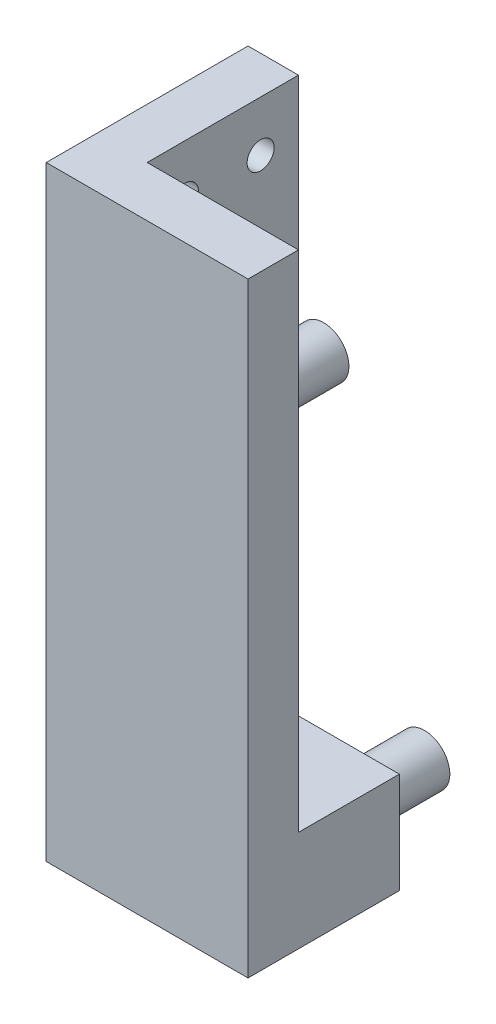
ISO-10303-21;
HEADER;
FILE_DESCRIPTION(('STEP AP214'),'2;1');
FILE_NAME('part.step','',(''),(''),'','','');
FILE_SCHEMA(('AUTOMOTIVE_DESIGN { 1 0 10303 214 1 1 1 1 }'));
ENDSEC;
DATA;
#1=APPLICATION_CONTEXT('core data for automotive mechanical design processes');
#2=APPLICATION_PROTOCOL_DEFINITION('international standard','automotive_design',2000,#1);
#3=PRODUCT_CONTEXT('',#1,'mechanical');
#4=PRODUCT('Part','Part','',(#3));
#5=PRODUCT_RELATED_PRODUCT_CATEGORY('part','',(#4));
#6=PRODUCT_DEFINITION_FORMATION('','',#4);
#7=PRODUCT_DEFINITION_CONTEXT('part definition',#1,'design');
#8=PRODUCT_DEFINITION('design','',#6,#7);
#9=PRODUCT_DEFINITION_SHAPE('','',#8);
#10=(LENGTH_UNIT() NAMED_UNIT(*) SI_UNIT(.MILLI.,.METRE.));
#11=(NAMED_UNIT(*) PLANE_ANGLE_UNIT() SI_UNIT($,.RADIAN.));
#12=(NAMED_UNIT(*) SI_UNIT($,.STERADIAN.) SOLID_ANGLE_UNIT());
#13=UNCERTAINTY_MEASURE_WITH_UNIT(LENGTH_MEASURE(1.E-05),#10,'distance_accuracy_value','');
#14=(GEOMETRIC_REPRESENTATION_CONTEXT(3) GLOBAL_UNCERTAINTY_ASSIGNED_CONTEXT((#13)) GLOBAL_UNIT_ASSIGNED_CONTEXT((#10,
#11,#12)) REPRESENTATION_CONTEXT('',''));
#15=CARTESIAN_POINT('',(0.,0.,0.));
#16=DIRECTION('',(0.,0.,1.));
#17=DIRECTION('',(1.,0.,0.));
#18=AXIS2_PLACEMENT_3D('',#15,#16,#17);
#19=CARTESIAN_POINT('',(0.,0.,25.4));
#20=DIRECTION('',(-1.,0.,0.));
#21=DIRECTION('',(0.,-1.,0.));
#22=AXIS2_PLACEMENT_3D('',#19,#20,#21);
#23=PLANE('',#22);
#24=CARTESIAN_POINT('',(0.,69.85,14.2875));
#25=DIRECTION('',(-1.,0.,0.));
#26=DIRECTION('',(0.,1.,0.));
#27=AXIS2_PLACEMENT_3D('',#24,#25,#26);
#28=CIRCLE('',#27,1.700000029);
#29=CARTESIAN_POINT('',(0.,71.550000029,14.2875));
#30=VERTEX_POINT('',#29);
#31=EDGE_CURVE('E224',#30,#30,#28,.T.);
#32=ORIENTED_EDGE('',*,*,#31,.F.);
#33=EDGE_LOOP('',(#32));
#34=FACE_BOUND('',#33,.T.);
#35=CARTESIAN_POINT('',(0.,19.0499999999999,4.7625));
#36=DIRECTION('',(-1.,0.,0.));
#37=DIRECTION('',(0.,1.,0.));
#38=AXIS2_PLACEMENT_3D('',#35,#36,#37);
#39=CIRCLE('',#38,1.700000029);
#40=CARTESIAN_POINT('',(0.,20.7500000289999,4.7625));
#41=VERTEX_POINT('',#40);
#42=EDGE_CURVE('E228',#41,#41,#39,.T.);
#43=ORIENTED_EDGE('',*,*,#42,.F.);
#44=EDGE_LOOP('',(#43));
#45=FACE_BOUND('',#44,.T.);
#46=CARTESIAN_POINT('',(0.,19.05,14.2875));
#47=DIRECTION('',(-1.,0.,0.));
#48=DIRECTION('',(0.,1.,0.));
#49=AXIS2_PLACEMENT_3D('',#46,#47,#48);
#50=CIRCLE('',#49,1.700000029);
#51=CARTESIAN_POINT('',(0.,20.750000029,14.2875));
#52=VERTEX_POINT('',#51);
#53=EDGE_CURVE('E232',#52,#52,#50,.T.);
#54=ORIENTED_EDGE('',*,*,#53,.F.);
#55=EDGE_LOOP('',(#54));
#56=FACE_BOUND('',#55,.T.);
#57=CARTESIAN_POINT('',(0.,69.85,4.7625));
#58=DIRECTION('',(-1.,0.,0.));
#59=DIRECTION('',(0.,1.,0.));
#60=AXIS2_PLACEMENT_3D('',#57,#58,#59);
#61=CIRCLE('',#60,1.700000029);
#62=CARTESIAN_POINT('',(0.,71.550000029,4.7625));
#63=VERTEX_POINT('',#62);
#64=EDGE_CURVE('E236',#63,#63,#61,.T.);
#65=ORIENTED_EDGE('',*,*,#64,.F.);
#66=EDGE_LOOP('',(#65));
#67=FACE_BOUND('',#66,.T.);
#68=DIRECTION('',(0.,-1.,0.));
#69=VECTOR('',#68,1.);
#70=CARTESIAN_POINT('',(0.,0.,0.));
#71=LINE('',#70,#69);
#72=CARTESIAN_POINT('',(0.,76.2,0.));
#73=VERTEX_POINT('',#72);
#74=CARTESIAN_POINT('',(0.,0.,0.));
#75=VERTEX_POINT('',#74);
#76=EDGE_CURVE('E164',#73,#75,#71,.T.);
#77=ORIENTED_EDGE('',*,*,#76,.T.);
#78=DIRECTION('',(0.,0.,-1.));
#79=VECTOR('',#78,1.);
#80=CARTESIAN_POINT('',(0.,0.,25.4));
#81=LINE('',#80,#79);
#82=CARTESIAN_POINT('',(0.,0.,25.4));
#83=VERTEX_POINT('',#82);
#84=EDGE_CURVE('E175',#83,#75,#81,.T.);
#85=ORIENTED_EDGE('',*,*,#84,.F.);
#86=DIRECTION('',(0.,-1.,0.));
#87=VECTOR('',#86,1.);
#88=CARTESIAN_POINT('',(0.,0.,25.4));
#89=LINE('',#88,#87);
#90=CARTESIAN_POINT('',(0.,76.2,25.4));
#91=VERTEX_POINT('',#90);
#92=EDGE_CURVE('E165',#91,#83,#89,.T.);
#93=ORIENTED_EDGE('',*,*,#92,.F.);
#94=DIRECTION('',(0.,0.,-1.));
#95=VECTOR('',#94,1.);
#96=CARTESIAN_POINT('',(0.,76.2,25.4));
#97=LINE('',#96,#95);
#98=EDGE_CURVE('E182',#91,#73,#97,.T.);
#99=ORIENTED_EDGE('',*,*,#98,.T.);
#100=EDGE_LOOP('',(#77,#85,#93,#99));
#101=FACE_BOUND('',#100,.T.);
#102=ADVANCED_FACE('F41',(#34,#45,#56,#67,#101),#23,.T.);
#103=CARTESIAN_POINT('',(0.,76.2,25.4));
#104=DIRECTION('',(0.,1.,0.));
#105=DIRECTION('',(0.,0.,-1.));
#106=AXIS2_PLACEMENT_3D('',#103,#104,#105);
#107=PLANE('',#106);
#108=DIRECTION('',(0.,0.,-1.));
#109=VECTOR('',#108,1.);
#110=CARTESIAN_POINT('',(6.34999999999998,76.2,19.05));
#111=LINE('',#110,#109);
#112=CARTESIAN_POINT('',(6.34999999999998,76.2,19.05));
#113=VERTEX_POINT('',#112);
#114=CARTESIAN_POINT('',(6.34999999999998,76.2,0.));
#115=VERTEX_POINT('',#114);
#116=EDGE_CURVE('E149',#113,#115,#111,.T.);
#117=ORIENTED_EDGE('',*,*,#116,.T.);
#118=DIRECTION('',(-1.,0.,0.));
#119=VECTOR('',#118,1.);
#120=CARTESIAN_POINT('',(0.,76.2,0.));
#121=LINE('',#120,#119);
#122=EDGE_CURVE('E169',#115,#73,#121,.T.);
#123=ORIENTED_EDGE('',*,*,#122,.T.);
#124=ORIENTED_EDGE('',*,*,#98,.F.);
#125=DIRECTION('',(-1.,0.,0.));
#126=VECTOR('',#125,1.);
#127=CARTESIAN_POINT('',(0.,76.2,25.4));
#128=LINE('',#127,#126);
#129=CARTESIAN_POINT('',(25.4,76.2,25.4));
#130=VERTEX_POINT('',#129);
#131=EDGE_CURVE('E173',#130,#91,#128,.T.);
#132=ORIENTED_EDGE('',*,*,#131,.F.);
#133=DIRECTION('',(0.,0.,-1.));
#134=VECTOR('',#133,1.);
#135=CARTESIAN_POINT('',(25.4,76.2,25.4));
#136=LINE('',#135,#134);
#137=CARTESIAN_POINT('',(25.4,76.2,19.05));
#138=VERTEX_POINT('',#137);
#139=EDGE_CURVE('E185',#130,#138,#136,.T.);
#140=ORIENTED_EDGE('',*,*,#139,.T.);
#141=DIRECTION('',(1.,0.,0.));
#142=VECTOR('',#141,1.);
#143=CARTESIAN_POINT('',(-78.5451621680164,76.1999999999999,19.05));
#144=LINE('',#143,#142);
#145=EDGE_CURVE('E154',#113,#138,#144,.T.);
#146=ORIENTED_EDGE('',*,*,#145,.F.);
#147=EDGE_LOOP('',(#117,#123,#124,#132,#140,#146));
#148=FACE_BOUND('',#147,.T.);
#149=ADVANCED_FACE('F213',(#148),#107,.T.);
#150=CARTESIAN_POINT('',(25.4,0.,25.4));
#151=DIRECTION('',(1.,0.,0.));
#152=DIRECTION('',(0.,1.,0.));
#153=AXIS2_PLACEMENT_3D('',#150,#151,#152);
#154=PLANE('',#153);
#155=DIRECTION('',(0.,1.,0.));
#156=VECTOR('',#155,1.);
#157=CARTESIAN_POINT('',(25.4,76.2,19.05));
#158=LINE('',#157,#156);
#159=CARTESIAN_POINT('',(25.4,12.7,19.05));
#160=VERTEX_POINT('',#159);
#161=EDGE_CURVE('E145',#160,#138,#158,.T.);
#162=ORIENTED_EDGE('',*,*,#161,.T.);
#163=ORIENTED_EDGE('',*,*,#139,.F.);
#164=DIRECTION('',(0.,1.,0.));
#165=VECTOR('',#164,1.);
#166=CARTESIAN_POINT('',(25.4,0.,25.4));
#167=LINE('',#166,#165);
#168=CARTESIAN_POINT('',(25.4,0.,25.4));
#169=VERTEX_POINT('',#168);
#170=EDGE_CURVE('E171',#169,#130,#167,.T.);
#171=ORIENTED_EDGE('',*,*,#170,.F.);
#172=DIRECTION('',(0.,0.,-1.));
#173=VECTOR('',#172,1.);
#174=CARTESIAN_POINT('',(25.4,0.,25.4));
#175=LINE('',#174,#173);
#176=CARTESIAN_POINT('',(25.4,0.,6.35000000000001));
#177=VERTEX_POINT('',#176);
#178=EDGE_CURVE('E188',#169,#177,#175,.T.);
#179=ORIENTED_EDGE('',*,*,#178,.T.);
#180=DIRECTION('',(0.,-1.,0.));
#181=VECTOR('',#180,1.);
#182=CARTESIAN_POINT('',(25.4,76.1999999999999,6.35));
#183=LINE('',#182,#181);
#184=CARTESIAN_POINT('',(25.4,12.7,6.35));
#185=VERTEX_POINT('',#184);
#186=EDGE_CURVE('E120',#185,#177,#183,.T.);
#187=ORIENTED_EDGE('',*,*,#186,.F.);
#188=DIRECTION('',(0.,0.,1.));
#189=VECTOR('',#188,1.);
#190=CARTESIAN_POINT('',(25.4,12.7,6.35));
#191=LINE('',#190,#189);
#192=EDGE_CURVE('E116',#185,#160,#191,.T.);
#193=ORIENTED_EDGE('',*,*,#192,.T.);
#194=EDGE_LOOP('',(#162,#163,#171,#179,#187,#193));
#195=FACE_BOUND('',#194,.T.);
#196=ADVANCED_FACE('F218',(#195),#154,.T.);
#197=CARTESIAN_POINT('',(0.,0.,25.4));
#198=DIRECTION('',(0.,-1.,0.));
#199=DIRECTION('',(0.,0.,1.));
#200=AXIS2_PLACEMENT_3D('',#197,#198,#199);
#201=PLANE('',#200);
#202=DIRECTION('',(0.,0.,1.));
#203=VECTOR('',#202,1.);
#204=CARTESIAN_POINT('',(6.34999999999999,0.,19.05));
#205=LINE('',#204,#203);
#206=CARTESIAN_POINT('',(6.34999999999999,0.,0.));
#207=VERTEX_POINT('',#206);
#208=CARTESIAN_POINT('',(6.34999999999999,0.,19.05));
#209=VERTEX_POINT('',#208);
#210=EDGE_CURVE('E156',#207,#209,#205,.T.);
#211=ORIENTED_EDGE('',*,*,#210,.T.);
#212=DIRECTION('',(1.,0.,0.));
#213=VECTOR('',#212,1.);
#214=CARTESIAN_POINT('',(-78.5451621680164,0.,19.05));
#215=LINE('',#214,#213);
#216=CARTESIAN_POINT('',(12.7,0.,19.05));
#217=VERTEX_POINT('',#216);
#218=EDGE_CURVE('E155',#209,#217,#215,.T.);
#219=ORIENTED_EDGE('',*,*,#218,.T.);
#220=DIRECTION('',(0.,0.,1.));
#221=VECTOR('',#220,1.);
#222=CARTESIAN_POINT('',(12.7,0.,6.35000000000001));
#223=LINE('',#222,#221);
#224=CARTESIAN_POINT('',(12.7,0.,6.35000000000001));
#225=VERTEX_POINT('',#224);
#226=EDGE_CURVE('E133',#225,#217,#223,.T.);
#227=ORIENTED_EDGE('',*,*,#226,.F.);
#228=DIRECTION('',(-1.,0.,0.));
#229=VECTOR('',#228,1.);
#230=CARTESIAN_POINT('',(-78.5451621680164,0.,6.35000000000001));
#231=LINE('',#230,#229);
#232=EDGE_CURVE('E125',#177,#225,#231,.T.);
#233=ORIENTED_EDGE('',*,*,#232,.F.);
#234=ORIENTED_EDGE('',*,*,#178,.F.);
#235=DIRECTION('',(1.,0.,0.));
#236=VECTOR('',#235,1.);
#237=CARTESIAN_POINT('',(0.,0.,25.4));
#238=LINE('',#237,#236);
#239=EDGE_CURVE('E168',#83,#169,#238,.T.);
#240=ORIENTED_EDGE('',*,*,#239,.F.);
#241=ORIENTED_EDGE('',*,*,#84,.T.);
#242=DIRECTION('',(1.,0.,0.));
#243=VECTOR('',#242,1.);
#244=CARTESIAN_POINT('',(0.,0.,0.));
#245=LINE('',#244,#243);
#246=EDGE_CURVE('E178',#75,#207,#245,.T.);
#247=ORIENTED_EDGE('',*,*,#246,.T.);
#248=EDGE_LOOP('',(#211,#219,#227,#233,#234,#240,#241,#247));
#249=FACE_BOUND('',#248,.T.);
#250=ADVANCED_FACE('F244',(#249),#201,.T.);
#251=CARTESIAN_POINT('',(0.,0.,25.4));
#252=DIRECTION('',(0.,0.,1.));
#253=DIRECTION('',(-1.,0.,0.));
#254=AXIS2_PLACEMENT_3D('',#251,#252,#253);
#255=PLANE('',#254);
#256=ORIENTED_EDGE('',*,*,#92,.T.);
#257=ORIENTED_EDGE('',*,*,#239,.T.);
#258=ORIENTED_EDGE('',*,*,#170,.T.);
#259=ORIENTED_EDGE('',*,*,#131,.T.);
#260=EDGE_LOOP('',(#256,#257,#258,#259));
#261=FACE_BOUND('',#260,.T.);
#262=ADVANCED_FACE('F248',(#261),#255,.T.);
#263=CARTESIAN_POINT('',(0.,0.,0.));
#264=DIRECTION('',(0.,0.,1.));
#265=DIRECTION('',(-1.,0.,0.));
#266=AXIS2_PLACEMENT_3D('',#263,#264,#265);
#267=PLANE('',#266);
#268=ORIENTED_EDGE('',*,*,#246,.F.);
#269=ORIENTED_EDGE('',*,*,#76,.F.);
#270=ORIENTED_EDGE('',*,*,#122,.F.);
#271=DIRECTION('',(0.,-1.,0.));
#272=VECTOR('',#271,1.);
#273=CARTESIAN_POINT('',(6.34999999999998,76.2,0.));
#274=LINE('',#273,#272);
#275=EDGE_CURVE('E63',#115,#207,#274,.T.);
#276=ORIENTED_EDGE('',*,*,#275,.T.);
#277=EDGE_LOOP('',(#268,#269,#270,#276));
#278=FACE_BOUND('',#277,.T.);
#279=ADVANCED_FACE('F242',(#278),#267,.F.);
#280=CARTESIAN_POINT('',(6.35,0.,25.4));
#281=DIRECTION('',(-1.,0.,0.));
#282=DIRECTION('',(0.,-1.,0.));
#283=AXIS2_PLACEMENT_3D('',#280,#281,#282);
#284=PLANE('',#283);
#285=CARTESIAN_POINT('',(6.34999999999999,69.85,14.2875));
#286=DIRECTION('',(-1.,0.,0.));
#287=DIRECTION('',(0.,1.,0.));
#288=AXIS2_PLACEMENT_3D('',#285,#286,#287);
#289=CIRCLE('',#288,1.700000029);
#290=CARTESIAN_POINT('',(6.34999999999999,71.550000029,14.2875));
#291=VERTEX_POINT('',#290);
#292=EDGE_CURVE('E271',#291,#291,#289,.T.);
#293=ORIENTED_EDGE('',*,*,#292,.T.);
#294=EDGE_LOOP('',(#293));
#295=FACE_BOUND('',#294,.T.);
#296=CARTESIAN_POINT('',(6.35,19.0499999999999,4.7625));
#297=DIRECTION('',(-1.,0.,0.));
#298=DIRECTION('',(0.,1.,0.));
#299=AXIS2_PLACEMENT_3D('',#296,#297,#298);
#300=CIRCLE('',#299,1.700000029);
#301=CARTESIAN_POINT('',(6.35,20.7500000289999,4.7625));
#302=VERTEX_POINT('',#301);
#303=EDGE_CURVE('E274',#302,#302,#300,.T.);
#304=ORIENTED_EDGE('',*,*,#303,.T.);
#305=EDGE_LOOP('',(#304));
#306=FACE_BOUND('',#305,.T.);
#307=CARTESIAN_POINT('',(6.35,19.05,14.2875));
#308=DIRECTION('',(-1.,0.,0.));
#309=DIRECTION('',(0.,1.,0.));
#310=AXIS2_PLACEMENT_3D('',#307,#308,#309);
#311=CIRCLE('',#310,1.700000029);
#312=CARTESIAN_POINT('',(6.35,20.750000029,14.2875));
#313=VERTEX_POINT('',#312);
#314=EDGE_CURVE('E275',#313,#313,#311,.T.);
#315=ORIENTED_EDGE('',*,*,#314,.T.);
#316=EDGE_LOOP('',(#315));
#317=FACE_BOUND('',#316,.T.);
#318=CARTESIAN_POINT('',(6.34999999999999,69.85,4.7625));
#319=DIRECTION('',(-1.,0.,0.));
#320=DIRECTION('',(0.,1.,0.));
#321=AXIS2_PLACEMENT_3D('',#318,#319,#320);
#322=CIRCLE('',#321,1.700000029);
#323=CARTESIAN_POINT('',(6.34999999999999,71.550000029,4.7625));
#324=VERTEX_POINT('',#323);
#325=EDGE_CURVE('E268',#324,#324,#322,.T.);
#326=ORIENTED_EDGE('',*,*,#325,.T.);
#327=EDGE_LOOP('',(#326));
#328=FACE_BOUND('',#327,.T.);
#329=DIRECTION('',(0.,1.,0.));
#330=VECTOR('',#329,1.);
#331=CARTESIAN_POINT('',(6.34999999999998,76.2,19.05));
#332=LINE('',#331,#330);
#333=EDGE_CURVE('E152',#209,#113,#332,.T.);
#334=ORIENTED_EDGE('',*,*,#333,.F.);
#335=ORIENTED_EDGE('',*,*,#210,.F.);
#336=ORIENTED_EDGE('',*,*,#275,.F.);
#337=ORIENTED_EDGE('',*,*,#116,.F.);
#338=EDGE_LOOP('',(#334,#335,#336,#337));
#339=FACE_BOUND('',#338,.T.);
#340=ADVANCED_FACE('F252',(#295,#306,#317,#328,#339),#284,.F.);
#341=CARTESIAN_POINT('',(-78.5451621680164,76.1999999999999,19.05));
#342=DIRECTION('',(0.,0.,1.));
#343=DIRECTION('',(0.,1.,0.));
#344=AXIS2_PLACEMENT_3D('',#341,#342,#343);
#345=PLANE('',#344);
#346=CARTESIAN_POINT('',(19.05,57.15,19.05));
#347=DIRECTION('',(0.,0.,-1.));
#348=DIRECTION('',(0.,1.,0.));
#349=AXIS2_PLACEMENT_3D('',#346,#347,#348);
#350=CIRCLE('',#349,3.175);
#351=CARTESIAN_POINT('',(15.875,57.15,19.05));
#352=VERTEX_POINT('',#351);
#353=EDGE_CURVE('E141',#352,#352,#350,.T.);
#354=ORIENTED_EDGE('',*,*,#353,.F.);
#355=EDGE_LOOP('',(#354));
#356=FACE_BOUND('',#355,.T.);
#357=ORIENTED_EDGE('',*,*,#218,.F.);
#358=ORIENTED_EDGE('',*,*,#333,.T.);
#359=ORIENTED_EDGE('',*,*,#145,.T.);
#360=ORIENTED_EDGE('',*,*,#161,.F.);
#361=DIRECTION('',(1.,0.,0.));
#362=VECTOR('',#361,1.);
#363=CARTESIAN_POINT('',(-78.5451621680164,12.7,19.05));
#364=LINE('',#363,#362);
#365=CARTESIAN_POINT('',(12.7,12.7,19.05));
#366=VERTEX_POINT('',#365);
#367=EDGE_CURVE('E55',#366,#160,#364,.T.);
#368=ORIENTED_EDGE('',*,*,#367,.F.);
#369=DIRECTION('',(0.,1.,0.));
#370=VECTOR('',#369,1.);
#371=CARTESIAN_POINT('',(12.7,76.1999999999999,19.05));
#372=LINE('',#371,#370);
#373=EDGE_CURVE('E131',#217,#366,#372,.T.);
#374=ORIENTED_EDGE('',*,*,#373,.F.);
#375=EDGE_LOOP('',(#357,#358,#359,#360,#368,#374));
#376=FACE_BOUND('',#375,.T.);
#377=ADVANCED_FACE('F207',(#356,#376),#345,.F.);
#378=CARTESIAN_POINT('',(19.05,57.15,9.525));
#379=DIRECTION('',(0.,0.,1.));
#380=DIRECTION('',(-1.,0.,0.));
#381=AXIS2_PLACEMENT_3D('',#378,#379,#380);
#382=CYLINDRICAL_SURFACE('',#381,3.175);
#383=CARTESIAN_POINT('',(19.05,57.15,9.525));
#384=DIRECTION('',(0.,0.,-1.));
#385=DIRECTION('',(0.,1.,0.));
#386=AXIS2_PLACEMENT_3D('',#383,#384,#385);
#387=CIRCLE('',#386,3.175);
#388=CARTESIAN_POINT('',(15.875,57.15,9.525));
#389=VERTEX_POINT('',#388);
#390=EDGE_CURVE('E142',#389,#389,#387,.T.);
#391=CARTESIAN_POINT('',(15.875,57.15,9.525));
#392=CARTESIAN_POINT('',(15.875,57.15,9.62421875));
#393=CARTESIAN_POINT('',(15.875,57.15,9.7234375));
#394=CARTESIAN_POINT('',(15.875,57.15,9.921875));
#395=CARTESIAN_POINT('',(15.875,57.15,10.02109375));
#396=CARTESIAN_POINT('',(15.875,57.15,10.21953125));
#397=CARTESIAN_POINT('',(15.875,57.15,10.31875));
#398=CARTESIAN_POINT('',(15.875,57.15,10.5171875));
#399=CARTESIAN_POINT('',(15.875,57.15,10.61640625));
#400=CARTESIAN_POINT('',(15.875,57.15,10.81484375));
#401=CARTESIAN_POINT('',(15.875,57.15,10.9140625));
#402=CARTESIAN_POINT('',(15.875,57.15,11.1125));
#403=CARTESIAN_POINT('',(15.875,57.15,11.21171875));
#404=CARTESIAN_POINT('',(15.875,57.15,11.41015625));
#405=CARTESIAN_POINT('',(15.875,57.15,11.509375));
#406=CARTESIAN_POINT('',(15.875,57.15,11.7078125));
#407=CARTESIAN_POINT('',(15.875,57.15,11.80703125));
#408=CARTESIAN_POINT('',(15.875,57.15,12.00546875));
#409=CARTESIAN_POINT('',(15.875,57.15,12.1046875));
#410=CARTESIAN_POINT('',(15.875,57.15,12.303125));
#411=CARTESIAN_POINT('',(15.875,57.15,12.40234375));
#412=CARTESIAN_POINT('',(15.875,57.15,12.60078125));
#413=CARTESIAN_POINT('',(15.875,57.15,12.7));
#414=CARTESIAN_POINT('',(15.875,57.15,12.8984375));
#415=CARTESIAN_POINT('',(15.875,57.15,12.99765625));
#416=CARTESIAN_POINT('',(15.875,57.15,13.19609375));
#417=CARTESIAN_POINT('',(15.875,57.15,13.2953125));
#418=CARTESIAN_POINT('',(15.875,57.15,13.49375));
#419=CARTESIAN_POINT('',(15.875,57.15,13.59296875));
#420=CARTESIAN_POINT('',(15.875,57.15,13.79140625));
#421=CARTESIAN_POINT('',(15.875,57.15,13.890625));
#422=CARTESIAN_POINT('',(15.875,57.15,14.0890625));
#423=CARTESIAN_POINT('',(15.875,57.15,14.18828125));
#424=CARTESIAN_POINT('',(15.875,57.15,14.38671875));
#425=CARTESIAN_POINT('',(15.875,57.15,14.4859375));
#426=CARTESIAN_POINT('',(15.875,57.15,14.684375));
#427=CARTESIAN_POINT('',(15.875,57.15,14.78359375));
#428=CARTESIAN_POINT('',(15.875,57.15,14.98203125));
#429=CARTESIAN_POINT('',(15.875,57.15,15.08125));
#430=CARTESIAN_POINT('',(15.875,57.15,15.2796875));
#431=CARTESIAN_POINT('',(15.875,57.15,15.37890625));
#432=CARTESIAN_POINT('',(15.875,57.15,15.57734375));
#433=CARTESIAN_POINT('',(15.875,57.15,15.6765625));
#434=CARTESIAN_POINT('',(15.875,57.15,15.875));
#435=CARTESIAN_POINT('',(15.875,57.15,15.97421875));
#436=CARTESIAN_POINT('',(15.875,57.15,16.17265625));
#437=CARTESIAN_POINT('',(15.875,57.15,16.271875));
#438=CARTESIAN_POINT('',(15.875,57.15,16.4703125));
#439=CARTESIAN_POINT('',(15.875,57.15,16.56953125));
#440=CARTESIAN_POINT('',(15.875,57.15,16.76796875));
#441=CARTESIAN_POINT('',(15.875,57.15,16.8671875));
#442=CARTESIAN_POINT('',(15.875,57.15,17.065625));
#443=CARTESIAN_POINT('',(15.875,57.15,17.16484375));
#444=CARTESIAN_POINT('',(15.875,57.15,17.36328125));
#445=CARTESIAN_POINT('',(15.875,57.15,17.4625));
#446=CARTESIAN_POINT('',(15.875,57.15,17.6609375));
#447=CARTESIAN_POINT('',(15.875,57.15,17.76015625));
#448=CARTESIAN_POINT('',(15.875,57.15,17.95859375));
#449=CARTESIAN_POINT('',(15.875,57.15,18.0578125));
#450=CARTESIAN_POINT('',(15.875,57.15,18.25625));
#451=CARTESIAN_POINT('',(15.875,57.15,18.35546875));
#452=CARTESIAN_POINT('',(15.875,57.15,18.55390625));
#453=CARTESIAN_POINT('',(15.875,57.15,18.653125));
#454=CARTESIAN_POINT('',(15.875,57.15,18.8515625));
#455=CARTESIAN_POINT('',(15.875,57.15,18.95078125));
#456=CARTESIAN_POINT('',(15.875,57.15,19.05));
#457=B_SPLINE_CURVE_WITH_KNOTS('',3,(#391,#392,#393,#394,#395,#396,#397,#398,#399,#400,#401,
#402,#403,#404,#405,#406,#407,#408,#409,#410,#411,#412,#413,#414,#415,#416,#417,#418,#419,#420,
#421,#422,#423,#424,#425,#426,#427,#428,#429,#430,#431,#432,#433,#434,#435,#436,#437,#438,#439,
#440,#441,#442,#443,#444,#445,#446,#447,#448,#449,#450,#451,#452,#453,#454,#455,#456),
.UNSPECIFIED.,.F.,.F.,(4,2,2,2,2,2,2,2,2,2,2,2,2,2,2,2,2,2,2,2,2,2,2,2,2,2,2,2,2,2,2,2,4),(0.,
0.297656249999998,0.595312499999999,0.892968749999999,1.190625,1.48828125,1.7859375,2.08359375,
2.38125,2.67890625,2.9765625,3.27421875,3.571875,3.86953125,4.1671875,4.46484375,4.7625,
5.06015625,5.3578125,5.65546875,5.953125,6.25078125,6.5484375,6.84609375,7.14375,7.44140625,
7.7390625,8.03671875,8.334375,8.63203125,8.9296875,9.22734375,9.525),.UNSPECIFIED.);
#458=EDGE_CURVE('BSEAM208',#389,#352,#457,.T.);
#459=ORIENTED_EDGE('',*,*,#390,.F.);
#460=ORIENTED_EDGE('',*,*,#353,.T.);
#461=ORIENTED_EDGE('',*,*,#458,.T.);
#462=ORIENTED_EDGE('',*,*,#458,.F.);
#463=EDGE_LOOP('',(#459,#461,#460,#462));
#464=FACE_BOUND('',#463,.T.);
#465=ADVANCED_FACE('F208',(#464),#382,.T.);
#466=CARTESIAN_POINT('',(19.05,57.15,9.525));
#467=DIRECTION('',(0.,0.,1.));
#468=DIRECTION('',(0.,1.,0.));
#469=AXIS2_PLACEMENT_3D('',#466,#467,#468);
#470=PLANE('',#469);
#471=CARTESIAN_POINT('',(19.05,57.15,9.525));
#472=DIRECTION('',(0.,0.,-1.));
#473=DIRECTION('',(0.,1.,0.));
#474=AXIS2_PLACEMENT_3D('',#471,#472,#473);
#475=CIRCLE('',#474,1.84999998300001);
#476=CARTESIAN_POINT('',(17.200000017,57.15,9.525));
#477=VERTEX_POINT('',#476);
#478=EDGE_CURVE('E138',#477,#477,#475,.T.);
#479=ORIENTED_EDGE('',*,*,#478,.F.);
#480=EDGE_LOOP('',(#479));
#481=FACE_BOUND('',#480,.T.);
#482=ORIENTED_EDGE('',*,*,#390,.T.);
#483=EDGE_LOOP('',(#482));
#484=FACE_BOUND('',#483,.T.);
#485=ADVANCED_FACE('F199',(#481,#484),#470,.F.);
#486=CARTESIAN_POINT('',(19.05,57.15,9.525));
#487=DIRECTION('',(0.,0.,1.));
#488=DIRECTION('',(-1.,0.,0.));
#489=AXIS2_PLACEMENT_3D('',#486,#487,#488);
#490=CYLINDRICAL_SURFACE('',#489,1.84999998300001);
#491=CARTESIAN_POINT('',(19.05,57.15,19.05));
#492=DIRECTION('',(0.,0.,-1.));
#493=DIRECTION('',(0.,1.,0.));
#494=AXIS2_PLACEMENT_3D('',#491,#492,#493);
#495=CIRCLE('',#494,1.84999998300001);
#496=CARTESIAN_POINT('',(17.200000017,57.15,19.05));
#497=VERTEX_POINT('',#496);
#498=EDGE_CURVE('E48',#497,#497,#495,.T.);
#499=CARTESIAN_POINT('',(17.200000017,57.15,9.525));
#500=CARTESIAN_POINT('',(17.200000017,57.15,9.62421875));
#501=CARTESIAN_POINT('',(17.200000017,57.15,9.7234375));
#502=CARTESIAN_POINT('',(17.200000017,57.15,9.921875));
#503=CARTESIAN_POINT('',(17.200000017,57.15,10.02109375));
#504=CARTESIAN_POINT('',(17.200000017,57.15,10.21953125));
#505=CARTESIAN_POINT('',(17.200000017,57.15,10.31875));
#506=CARTESIAN_POINT('',(17.200000017,57.15,10.5171875));
#507=CARTESIAN_POINT('',(17.200000017,57.15,10.61640625));
#508=CARTESIAN_POINT('',(17.200000017,57.15,10.81484375));
#509=CARTESIAN_POINT('',(17.200000017,57.15,10.9140625));
#510=CARTESIAN_POINT('',(17.200000017,57.15,11.1125));
#511=CARTESIAN_POINT('',(17.200000017,57.15,11.21171875));
#512=CARTESIAN_POINT('',(17.200000017,57.15,11.41015625));
#513=CARTESIAN_POINT('',(17.200000017,57.15,11.509375));
#514=CARTESIAN_POINT('',(17.200000017,57.15,11.7078125));
#515=CARTESIAN_POINT('',(17.200000017,57.15,11.80703125));
#516=CARTESIAN_POINT('',(17.200000017,57.15,12.00546875));
#517=CARTESIAN_POINT('',(17.200000017,57.15,12.1046875));
#518=CARTESIAN_POINT('',(17.200000017,57.15,12.303125));
#519=CARTESIAN_POINT('',(17.200000017,57.15,12.40234375));
#520=CARTESIAN_POINT('',(17.200000017,57.15,12.60078125));
#521=CARTESIAN_POINT('',(17.200000017,57.15,12.7));
#522=CARTESIAN_POINT('',(17.200000017,57.15,12.8984375));
#523=CARTESIAN_POINT('',(17.200000017,57.15,12.99765625));
#524=CARTESIAN_POINT('',(17.200000017,57.15,13.19609375));
#525=CARTESIAN_POINT('',(17.200000017,57.15,13.2953125));
#526=CARTESIAN_POINT('',(17.200000017,57.15,13.49375));
#527=CARTESIAN_POINT('',(17.200000017,57.15,13.59296875));
#528=CARTESIAN_POINT('',(17.200000017,57.15,13.79140625));
#529=CARTESIAN_POINT('',(17.200000017,57.15,13.890625));
#530=CARTESIAN_POINT('',(17.200000017,57.15,14.0890625));
#531=CARTESIAN_POINT('',(17.200000017,57.15,14.18828125));
#532=CARTESIAN_POINT('',(17.200000017,57.15,14.38671875));
#533=CARTESIAN_POINT('',(17.200000017,57.15,14.4859375));
#534=CARTESIAN_POINT('',(17.200000017,57.15,14.684375));
#535=CARTESIAN_POINT('',(17.200000017,57.15,14.78359375));
#536=CARTESIAN_POINT('',(17.200000017,57.15,14.98203125));
#537=CARTESIAN_POINT('',(17.200000017,57.15,15.08125));
#538=CARTESIAN_POINT('',(17.200000017,57.15,15.2796875));
#539=CARTESIAN_POINT('',(17.200000017,57.15,15.37890625));
#540=CARTESIAN_POINT('',(17.200000017,57.15,15.57734375));
#541=CARTESIAN_POINT('',(17.200000017,57.15,15.6765625));
#542=CARTESIAN_POINT('',(17.200000017,57.15,15.875));
#543=CARTESIAN_POINT('',(17.200000017,57.15,15.97421875));
#544=CARTESIAN_POINT('',(17.200000017,57.15,16.17265625));
#545=CARTESIAN_POINT('',(17.200000017,57.15,16.271875));
#546=CARTESIAN_POINT('',(17.200000017,57.15,16.4703125));
#547=CARTESIAN_POINT('',(17.200000017,57.15,16.56953125));
#548=CARTESIAN_POINT('',(17.200000017,57.15,16.76796875));
#549=CARTESIAN_POINT('',(17.200000017,57.15,16.8671875));
#550=CARTESIAN_POINT('',(17.200000017,57.15,17.065625));
#551=CARTESIAN_POINT('',(17.200000017,57.15,17.16484375));
#552=CARTESIAN_POINT('',(17.200000017,57.15,17.36328125));
#553=CARTESIAN_POINT('',(17.200000017,57.15,17.4625));
#554=CARTESIAN_POINT('',(17.200000017,57.15,17.6609375));
#555=CARTESIAN_POINT('',(17.200000017,57.15,17.76015625));
#556=CARTESIAN_POINT('',(17.200000017,57.15,17.95859375));
#557=CARTESIAN_POINT('',(17.200000017,57.15,18.0578125));
#558=CARTESIAN_POINT('',(17.200000017,57.15,18.25625));
#559=CARTESIAN_POINT('',(17.200000017,57.15,18.35546875));
#560=CARTESIAN_POINT('',(17.200000017,57.15,18.55390625));
#561=CARTESIAN_POINT('',(17.200000017,57.15,18.653125));
#562=CARTESIAN_POINT('',(17.200000017,57.15,18.8515625));
#563=CARTESIAN_POINT('',(17.200000017,57.15,18.95078125));
#564=CARTESIAN_POINT('',(17.200000017,57.15,19.05));
#565=B_SPLINE_CURVE_WITH_KNOTS('',3,(#499,#500,#501,#502,#503,#504,#505,#506,#507,#508,#509,
#510,#511,#512,#513,#514,#515,#516,#517,#518,#519,#520,#521,#522,#523,#524,#525,#526,#527,#528,
#529,#530,#531,#532,#533,#534,#535,#536,#537,#538,#539,#540,#541,#542,#543,#544,#545,#546,#547,
#548,#549,#550,#551,#552,#553,#554,#555,#556,#557,#558,#559,#560,#561,#562,#563,#564),
.UNSPECIFIED.,.F.,.F.,(4,2,2,2,2,2,2,2,2,2,2,2,2,2,2,2,2,2,2,2,2,2,2,2,2,2,2,2,2,2,2,2,4),(0.,
0.297656249999998,0.595312499999999,0.892968749999999,1.190625,1.48828125,1.7859375,2.08359375,
2.38125,2.67890625,2.9765625,3.27421875,3.571875,3.86953125,4.1671875,4.46484375,4.7625,
5.06015625,5.35781249999999,5.65546874999999,5.95312499999999,6.25078124999999,6.5484375,
6.84609375,7.14375,7.44140625,7.7390625,8.03671875,8.334375,8.63203125,8.92968749999999,
9.22734374999999,9.52499999999999),.UNSPECIFIED.);
#566=EDGE_CURVE('BSEAM197',#477,#497,#565,.T.);
#567=ORIENTED_EDGE('',*,*,#478,.T.);
#568=ORIENTED_EDGE('',*,*,#498,.F.);
#569=ORIENTED_EDGE('',*,*,#566,.T.);
#570=ORIENTED_EDGE('',*,*,#566,.F.);
#571=EDGE_LOOP('',(#567,#569,#568,#570));
#572=FACE_BOUND('',#571,.T.);
#573=ADVANCED_FACE('F197',(#572),#490,.F.);
#574=ORIENTED_EDGE('',*,*,#498,.T.);
#575=EDGE_LOOP('',(#574));
#576=FACE_BOUND('',#575,.T.);
#577=ADVANCED_FACE('F195',(#576),#345,.F.);
#578=CARTESIAN_POINT('',(12.7,76.1999999999999,6.35));
#579=DIRECTION('',(-1.,0.,0.));
#580=DIRECTION('',(0.,0.,-1.));
#581=AXIS2_PLACEMENT_3D('',#578,#579,#580);
#582=PLANE('',#581);
#583=ORIENTED_EDGE('',*,*,#373,.T.);
#584=DIRECTION('',(0.,0.,1.));
#585=VECTOR('',#584,1.);
#586=CARTESIAN_POINT('',(12.7,12.7,6.35));
#587=LINE('',#586,#585);
#588=CARTESIAN_POINT('',(12.7,12.7,6.35));
#589=VERTEX_POINT('',#588);
#590=EDGE_CURVE('E114',#589,#366,#587,.T.);
#591=ORIENTED_EDGE('',*,*,#590,.F.);
#592=DIRECTION('',(0.,1.,0.));
#593=VECTOR('',#592,1.);
#594=CARTESIAN_POINT('',(12.7,76.1999999999999,6.35));
#595=LINE('',#594,#593);
#596=EDGE_CURVE('E121',#225,#589,#595,.T.);
#597=ORIENTED_EDGE('',*,*,#596,.F.);
#598=ORIENTED_EDGE('',*,*,#226,.T.);
#599=EDGE_LOOP('',(#583,#591,#597,#598));
#600=FACE_BOUND('',#599,.T.);
#601=ADVANCED_FACE('F130',(#600),#582,.T.);
#602=CARTESIAN_POINT('',(-78.5451621680164,12.7,6.35));
#603=DIRECTION('',(0.,1.,0.));
#604=DIRECTION('',(0.,0.,-1.));
#605=AXIS2_PLACEMENT_3D('',#602,#603,#604);
#606=PLANE('',#605);
#607=ORIENTED_EDGE('',*,*,#367,.T.);
#608=ORIENTED_EDGE('',*,*,#192,.F.);
#609=DIRECTION('',(1.,0.,0.));
#610=VECTOR('',#609,1.);
#611=CARTESIAN_POINT('',(-78.5451621680164,12.7,6.35));
#612=LINE('',#611,#610);
#613=EDGE_CURVE('E110',#589,#185,#612,.T.);
#614=ORIENTED_EDGE('',*,*,#613,.F.);
#615=ORIENTED_EDGE('',*,*,#590,.T.);
#616=EDGE_LOOP('',(#607,#608,#614,#615));
#617=FACE_BOUND('',#616,.T.);
#618=ADVANCED_FACE('F112',(#617),#606,.T.);
#619=CARTESIAN_POINT('',(0.,0.,6.35));
#620=DIRECTION('',(0.,0.,1.));
#621=DIRECTION('',(0.,1.,0.));
#622=AXIS2_PLACEMENT_3D('',#619,#620,#621);
#623=PLANE('',#622);
#624=CARTESIAN_POINT('',(19.05,6.35,6.35));
#625=DIRECTION('',(0.,0.,-1.));
#626=DIRECTION('',(0.,1.,0.));
#627=AXIS2_PLACEMENT_3D('',#624,#625,#626);
#628=CIRCLE('',#627,3.175);
#629=CARTESIAN_POINT('',(15.875,6.35,6.35));
#630=VERTEX_POINT('',#629);
#631=EDGE_CURVE('E12',#630,#630,#628,.F.);
#632=ORIENTED_EDGE('',*,*,#631,.T.);
#633=EDGE_LOOP('',(#632));
#634=FACE_BOUND('',#633,.T.);
#635=ORIENTED_EDGE('',*,*,#596,.T.);
#636=ORIENTED_EDGE('',*,*,#613,.T.);
#637=ORIENTED_EDGE('',*,*,#186,.T.);
#638=ORIENTED_EDGE('',*,*,#232,.T.);
#639=EDGE_LOOP('',(#635,#636,#637,#638));
#640=FACE_BOUND('',#639,.T.);
#641=ADVANCED_FACE('F124',(#634,#640),#623,.F.);
#642=CARTESIAN_POINT('',(19.05,6.35,-3.175));
#643=DIRECTION('',(0.,0.,-1.));
#644=DIRECTION('',(1.,0.,0.));
#645=AXIS2_PLACEMENT_3D('',#642,#643,#644);
#646=PLANE('',#645);
#647=CARTESIAN_POINT('',(19.05,6.35,-3.175));
#648=DIRECTION('',(0.,0.,1.));
#649=DIRECTION('',(1.,0.,0.));
#650=AXIS2_PLACEMENT_3D('',#647,#648,#649);
#651=CIRCLE('',#650,3.175);
#652=CARTESIAN_POINT('',(15.875,6.35,-3.175));
#653=VERTEX_POINT('',#652);
#654=EDGE_CURVE('E257',#653,#653,#651,.T.);
#655=ORIENTED_EDGE('',*,*,#654,.F.);
#656=EDGE_LOOP('',(#655));
#657=FACE_BOUND('',#656,.T.);
#658=CARTESIAN_POINT('',(19.05,6.35,-3.175));
#659=DIRECTION('',(0.,0.,1.));
#660=DIRECTION('',(1.,0.,0.));
#661=AXIS2_PLACEMENT_3D('',#658,#659,#660);
#662=CIRCLE('',#661,1.84999998300001);
#663=CARTESIAN_POINT('',(17.200000017,6.35,-3.175));
#664=VERTEX_POINT('',#663);
#665=EDGE_CURVE('E262',#664,#664,#662,.T.);
#666=ORIENTED_EDGE('',*,*,#665,.T.);
#667=EDGE_LOOP('',(#666));
#668=FACE_BOUND('',#667,.T.);
#669=ADVANCED_FACE('F312',(#657,#668),#646,.T.);
#670=CARTESIAN_POINT('',(19.05,6.35,-3.175));
#671=DIRECTION('',(0.,0.,1.));
#672=DIRECTION('',(-1.,0.,0.));
#673=AXIS2_PLACEMENT_3D('',#670,#671,#672);
#674=CYLINDRICAL_SURFACE('',#673,3.175);
#675=CARTESIAN_POINT('',(15.875,6.35,-3.175));
#676=CARTESIAN_POINT('',(15.875,6.35,-3.07578125));
#677=CARTESIAN_POINT('',(15.875,6.35,-2.9765625));
#678=CARTESIAN_POINT('',(15.875,6.35,-2.778125));
#679=CARTESIAN_POINT('',(15.875,6.35,-2.67890625));
#680=CARTESIAN_POINT('',(15.875,6.35,-2.48046875));
#681=CARTESIAN_POINT('',(15.875,6.35,-2.38125));
#682=CARTESIAN_POINT('',(15.875,6.35,-2.1828125));
#683=CARTESIAN_POINT('',(15.875,6.35,-2.08359375));
#684=CARTESIAN_POINT('',(15.875,6.35,-1.88515625));
#685=CARTESIAN_POINT('',(15.875,6.35,-1.7859375));
#686=CARTESIAN_POINT('',(15.875,6.35,-1.5875));
#687=CARTESIAN_POINT('',(15.875,6.35,-1.48828125));
#688=CARTESIAN_POINT('',(15.875,6.35,-1.28984375));
#689=CARTESIAN_POINT('',(15.875,6.35,-1.190625));
#690=CARTESIAN_POINT('',(15.875,6.35,-0.992187499999995));
#691=CARTESIAN_POINT('',(15.875,6.35,-0.892968749999995));
#692=CARTESIAN_POINT('',(15.875,6.35,-0.694531249999995));
#693=CARTESIAN_POINT('',(15.875,6.35,-0.595312499999995));
#694=CARTESIAN_POINT('',(15.875,6.35,-0.396874999999995));
#695=CARTESIAN_POINT('',(15.875,6.35,-0.297656249999995));
#696=CARTESIAN_POINT('',(15.875,6.35,-0.0992187499999951));
#697=CARTESIAN_POINT('',(15.875,6.35,0.));
#698=CARTESIAN_POINT('',(15.875,6.35,0.198437500000005));
#699=CARTESIAN_POINT('',(15.875,6.35,0.297656250000005));
#700=CARTESIAN_POINT('',(15.875,6.35,0.496093750000005));
#701=CARTESIAN_POINT('',(15.875,6.35,0.595312500000005));
#702=CARTESIAN_POINT('',(15.875,6.35,0.793750000000005));
#703=CARTESIAN_POINT('',(15.875,6.35,0.892968750000005));
#704=CARTESIAN_POINT('',(15.875,6.35,1.09140625));
#705=CARTESIAN_POINT('',(15.875,6.35,1.190625));
#706=CARTESIAN_POINT('',(15.875,6.35,1.3890625));
#707=CARTESIAN_POINT('',(15.875,6.35,1.48828125));
#708=CARTESIAN_POINT('',(15.875,6.35,1.68671875));
#709=CARTESIAN_POINT('',(15.875,6.35,1.7859375));
#710=CARTESIAN_POINT('',(15.875,6.35,1.984375));
#711=CARTESIAN_POINT('',(15.875,6.35,2.08359375000001));
#712=CARTESIAN_POINT('',(15.875,6.35,2.28203125000001));
#713=CARTESIAN_POINT('',(15.875,6.35,2.38125000000001));
#714=CARTESIAN_POINT('',(15.875,6.35,2.57968750000001));
#715=CARTESIAN_POINT('',(15.875,6.35,2.67890625000001));
#716=CARTESIAN_POINT('',(15.875,6.35,2.87734375000001));
#717=CARTESIAN_POINT('',(15.875,6.35,2.9765625));
#718=CARTESIAN_POINT('',(15.875,6.35,3.175));
#719=CARTESIAN_POINT('',(15.875,6.35,3.27421875000001));
#720=CARTESIAN_POINT('',(15.875,6.35,3.47265625));
#721=CARTESIAN_POINT('',(15.875,6.35,3.57187500000001));
#722=CARTESIAN_POINT('',(15.875,6.35,3.77031250000001));
#723=CARTESIAN_POINT('',(15.875,6.35,3.86953125000001));
#724=CARTESIAN_POINT('',(15.875,6.35,4.06796875000001));
#725=CARTESIAN_POINT('',(15.875,6.35,4.16718750000001));
#726=CARTESIAN_POINT('',(15.875,6.35,4.36562500000001));
#727=CARTESIAN_POINT('',(15.875,6.35,4.46484375000001));
#728=CARTESIAN_POINT('',(15.875,6.35,4.66328125000001));
#729=CARTESIAN_POINT('',(15.875,6.35,4.7625));
#730=CARTESIAN_POINT('',(15.875,6.35,4.9609375));
#731=CARTESIAN_POINT('',(15.875,6.35,5.06015625));
#732=CARTESIAN_POINT('',(15.875,6.35,5.25859375));
#733=CARTESIAN_POINT('',(15.875,6.35,5.3578125));
#734=CARTESIAN_POINT('',(15.875,6.35,5.55625));
#735=CARTESIAN_POINT('',(15.875,6.35,5.65546875));
#736=CARTESIAN_POINT('',(15.875,6.35,5.85390625));
#737=CARTESIAN_POINT('',(15.875,6.35,5.953125));
#738=CARTESIAN_POINT('',(15.875,6.35,6.15156250000001));
#739=CARTESIAN_POINT('',(15.875,6.35,6.25078125));
#740=CARTESIAN_POINT('',(15.875,6.35,6.35));
#741=B_SPLINE_CURVE_WITH_KNOTS('',3,(#675,#676,#677,#678,#679,#680,#681,#682,#683,#684,#685,
#686,#687,#688,#689,#690,#691,#692,#693,#694,#695,#696,#697,#698,#699,#700,#701,#702,#703,#704,
#705,#706,#707,#708,#709,#710,#711,#712,#713,#714,#715,#716,#717,#718,#719,#720,#721,#722,#723,
#724,#725,#726,#727,#728,#729,#730,#731,#732,#733,#734,#735,#736,#737,#738,#739,#740),
.UNSPECIFIED.,.F.,.F.,(4,2,2,2,2,2,2,2,2,2,2,2,2,2,2,2,2,2,2,2,2,2,2,2,2,2,2,2,2,2,2,2,4),(0.,
0.29765625,0.5953125,0.89296875,1.190625,1.48828125,1.7859375,2.08359375,2.38125,2.67890625,
2.9765625,3.27421875,3.571875,3.86953125,4.1671875,4.46484375,4.7625,5.06015625,5.3578125,
5.65546875,5.953125,6.25078125,6.5484375,6.84609375,7.14375,7.44140625,7.7390625,8.03671875,
8.334375,8.63203125,8.9296875,9.22734375,9.525),.UNSPECIFIED.);
#742=EDGE_CURVE('BSEAM310',#653,#630,#741,.T.);
#743=ORIENTED_EDGE('',*,*,#654,.T.);
#744=ORIENTED_EDGE('',*,*,#631,.F.);
#745=ORIENTED_EDGE('',*,*,#742,.T.);
#746=ORIENTED_EDGE('',*,*,#742,.F.);
#747=EDGE_LOOP('',(#743,#745,#744,#746));
#748=FACE_BOUND('',#747,.T.);
#749=ADVANCED_FACE('F310',(#748),#674,.T.);
#750=CARTESIAN_POINT('',(19.05,6.35,-3.175));
#751=DIRECTION('',(0.,0.,1.));
#752=DIRECTION('',(-1.,0.,0.));
#753=AXIS2_PLACEMENT_3D('',#750,#751,#752);
#754=CYLINDRICAL_SURFACE('',#753,1.84999998300001);
#755=CARTESIAN_POINT('',(19.05,6.35,6.35));
#756=DIRECTION('',(0.,0.,1.));
#757=DIRECTION('',(1.,0.,0.));
#758=AXIS2_PLACEMENT_3D('',#755,#756,#757);
#759=CIRCLE('',#758,1.84999998300001);
#760=CARTESIAN_POINT('',(17.200000017,6.35,6.35));
#761=VERTEX_POINT('',#760);
#762=EDGE_CURVE('E263',#761,#761,#759,.T.);
#763=CARTESIAN_POINT('',(17.200000017,6.35,-3.175));
#764=CARTESIAN_POINT('',(17.200000017,6.35,-3.07578125));
#765=CARTESIAN_POINT('',(17.200000017,6.35,-2.9765625));
#766=CARTESIAN_POINT('',(17.200000017,6.35,-2.778125));
#767=CARTESIAN_POINT('',(17.200000017,6.35,-2.67890625));
#768=CARTESIAN_POINT('',(17.200000017,6.35,-2.48046875));
#769=CARTESIAN_POINT('',(17.200000017,6.35,-2.38125));
#770=CARTESIAN_POINT('',(17.200000017,6.35,-2.1828125));
#771=CARTESIAN_POINT('',(17.200000017,6.35,-2.08359375));
#772=CARTESIAN_POINT('',(17.200000017,6.35,-1.88515625));
#773=CARTESIAN_POINT('',(17.200000017,6.35,-1.7859375));
#774=CARTESIAN_POINT('',(17.200000017,6.35,-1.5875));
#775=CARTESIAN_POINT('',(17.200000017,6.35,-1.48828125));
#776=CARTESIAN_POINT('',(17.200000017,6.35,-1.28984375));
#777=CARTESIAN_POINT('',(17.200000017,6.35,-1.190625));
#778=CARTESIAN_POINT('',(17.200000017,6.35,-0.992187499999995));
#779=CARTESIAN_POINT('',(17.200000017,6.35,-0.892968749999995));
#780=CARTESIAN_POINT('',(17.200000017,6.35,-0.694531249999995));
#781=CARTESIAN_POINT('',(17.200000017,6.35,-0.595312499999995));
#782=CARTESIAN_POINT('',(17.200000017,6.35,-0.396874999999995));
#783=CARTESIAN_POINT('',(17.200000017,6.35,-0.297656249999995));
#784=CARTESIAN_POINT('',(17.200000017,6.35,-0.0992187499999951));
#785=CARTESIAN_POINT('',(17.200000017,6.35,0.));
#786=CARTESIAN_POINT('',(17.200000017,6.35,0.198437500000005));
#787=CARTESIAN_POINT('',(17.200000017,6.35,0.297656250000005));
#788=CARTESIAN_POINT('',(17.200000017,6.35,0.496093750000005));
#789=CARTESIAN_POINT('',(17.200000017,6.35,0.595312500000005));
#790=CARTESIAN_POINT('',(17.200000017,6.35,0.793750000000005));
#791=CARTESIAN_POINT('',(17.200000017,6.35,0.892968750000005));
#792=CARTESIAN_POINT('',(17.200000017,6.35,1.09140625));
#793=CARTESIAN_POINT('',(17.200000017,6.35,1.190625));
#794=CARTESIAN_POINT('',(17.200000017,6.35,1.3890625));
#795=CARTESIAN_POINT('',(17.200000017,6.35,1.48828125));
#796=CARTESIAN_POINT('',(17.200000017,6.35,1.68671875));
#797=CARTESIAN_POINT('',(17.200000017,6.35,1.7859375));
#798=CARTESIAN_POINT('',(17.200000017,6.35,1.984375));
#799=CARTESIAN_POINT('',(17.200000017,6.35,2.08359375000001));
#800=CARTESIAN_POINT('',(17.200000017,6.35,2.28203125000001));
#801=CARTESIAN_POINT('',(17.200000017,6.35,2.38125000000001));
#802=CARTESIAN_POINT('',(17.200000017,6.35,2.57968750000001));
#803=CARTESIAN_POINT('',(17.200000017,6.35,2.67890625000001));
#804=CARTESIAN_POINT('',(17.200000017,6.35,2.87734375000001));
#805=CARTESIAN_POINT('',(17.200000017,6.35,2.9765625));
#806=CARTESIAN_POINT('',(17.200000017,6.35,3.175));
#807=CARTESIAN_POINT('',(17.200000017,6.35,3.27421875000001));
#808=CARTESIAN_POINT('',(17.200000017,6.35,3.47265625));
#809=CARTESIAN_POINT('',(17.200000017,6.35,3.57187500000001));
#810=CARTESIAN_POINT('',(17.200000017,6.35,3.77031250000001));
#811=CARTESIAN_POINT('',(17.200000017,6.35,3.86953125000001));
#812=CARTESIAN_POINT('',(17.200000017,6.35,4.06796875000001));
#813=CARTESIAN_POINT('',(17.200000017,6.35,4.16718750000001));
#814=CARTESIAN_POINT('',(17.200000017,6.35,4.36562500000001));
#815=CARTESIAN_POINT('',(17.200000017,6.35,4.46484375000001));
#816=CARTESIAN_POINT('',(17.200000017,6.35,4.66328125000001));
#817=CARTESIAN_POINT('',(17.200000017,6.35,4.7625));
#818=CARTESIAN_POINT('',(17.200000017,6.35,4.9609375));
#819=CARTESIAN_POINT('',(17.200000017,6.35,5.06015625));
#820=CARTESIAN_POINT('',(17.200000017,6.35,5.25859375));
#821=CARTESIAN_POINT('',(17.200000017,6.35,5.3578125));
#822=CARTESIAN_POINT('',(17.200000017,6.35,5.55625));
#823=CARTESIAN_POINT('',(17.200000017,6.35,5.65546875));
#824=CARTESIAN_POINT('',(17.200000017,6.35,5.85390625));
#825=CARTESIAN_POINT('',(17.200000017,6.35,5.953125));
#826=CARTESIAN_POINT('',(17.200000017,6.35,6.15156250000001));
#827=CARTESIAN_POINT('',(17.200000017,6.35,6.25078125));
#828=CARTESIAN_POINT('',(17.200000017,6.35,6.35));
#829=B_SPLINE_CURVE_WITH_KNOTS('',3,(#763,#764,#765,#766,#767,#768,#769,#770,#771,#772,#773,
#774,#775,#776,#777,#778,#779,#780,#781,#782,#783,#784,#785,#786,#787,#788,#789,#790,#791,#792,
#793,#794,#795,#796,#797,#798,#799,#800,#801,#802,#803,#804,#805,#806,#807,#808,#809,#810,#811,
#812,#813,#814,#815,#816,#817,#818,#819,#820,#821,#822,#823,#824,#825,#826,#827,#828),
.UNSPECIFIED.,.F.,.F.,(4,2,2,2,2,2,2,2,2,2,2,2,2,2,2,2,2,2,2,2,2,2,2,2,2,2,2,2,2,2,2,2,4),(0.,
0.29765625,0.5953125,0.89296875,1.190625,1.48828125,1.7859375,2.08359375,2.38125,2.67890625,
2.9765625,3.27421875,3.571875,3.86953125,4.1671875,4.46484375,4.7625,5.06015625,5.3578125,
5.65546875,5.953125,6.25078125,6.5484375,6.84609375,7.14375,7.44140625,7.7390625,8.03671875,
8.334375,8.63203125,8.9296875,9.22734375,9.525),.UNSPECIFIED.);
#830=EDGE_CURVE('BSEAM307',#664,#761,#829,.T.);
#831=ORIENTED_EDGE('',*,*,#665,.F.);
#832=ORIENTED_EDGE('',*,*,#762,.T.);
#833=ORIENTED_EDGE('',*,*,#830,.T.);
#834=ORIENTED_EDGE('',*,*,#830,.F.);
#835=EDGE_LOOP('',(#831,#833,#832,#834));
#836=FACE_BOUND('',#835,.T.);
#837=ADVANCED_FACE('F307',(#836),#754,.F.);
#838=ORIENTED_EDGE('',*,*,#762,.F.);
#839=EDGE_LOOP('',(#838));
#840=FACE_BOUND('',#839,.T.);
#841=ADVANCED_FACE('F300',(#840),#623,.F.);
#842=CARTESIAN_POINT('',(0.,69.85,4.7625));
#843=DIRECTION('',(1.,0.,0.));
#844=DIRECTION('',(0.,1.,0.));
#845=AXIS2_PLACEMENT_3D('',#842,#843,#844);
#846=CYLINDRICAL_SURFACE('',#845,1.700000029);
#847=ORIENTED_EDGE('',*,*,#64,.T.);
#848=EDGE_LOOP('',(#847));
#849=FACE_BOUND('',#848,.T.);
#850=ORIENTED_EDGE('',*,*,#325,.F.);
#851=EDGE_LOOP('',(#850));
#852=FACE_BOUND('',#851,.T.);
#853=ADVANCED_FACE('F290',(#849,#852),#846,.F.);
#854=CARTESIAN_POINT('',(0.,19.05,14.2875));
#855=DIRECTION('',(1.,0.,0.));
#856=DIRECTION('',(0.,1.,0.));
#857=AXIS2_PLACEMENT_3D('',#854,#855,#856);
#858=CYLINDRICAL_SURFACE('',#857,1.700000029);
#859=ORIENTED_EDGE('',*,*,#53,.T.);
#860=EDGE_LOOP('',(#859));
#861=FACE_BOUND('',#860,.T.);
#862=ORIENTED_EDGE('',*,*,#314,.F.);
#863=EDGE_LOOP('',(#862));
#864=FACE_BOUND('',#863,.T.);
#865=ADVANCED_FACE('F287',(#861,#864),#858,.F.);
#866=CARTESIAN_POINT('',(0.,19.0499999999999,4.7625));
#867=DIRECTION('',(1.,0.,0.));
#868=DIRECTION('',(0.,1.,0.));
#869=AXIS2_PLACEMENT_3D('',#866,#867,#868);
#870=CYLINDRICAL_SURFACE('',#869,1.700000029);
#871=ORIENTED_EDGE('',*,*,#42,.T.);
#872=EDGE_LOOP('',(#871));
#873=FACE_BOUND('',#872,.T.);
#874=ORIENTED_EDGE('',*,*,#303,.F.);
#875=EDGE_LOOP('',(#874));
#876=FACE_BOUND('',#875,.T.);
#877=ADVANCED_FACE('F289',(#873,#876),#870,.F.);
#878=CARTESIAN_POINT('',(0.,69.85,14.2875));
#879=DIRECTION('',(1.,0.,0.));
#880=DIRECTION('',(0.,1.,0.));
#881=AXIS2_PLACEMENT_3D('',#878,#879,#880);
#882=CYLINDRICAL_SURFACE('',#881,1.700000029);
#883=ORIENTED_EDGE('',*,*,#31,.T.);
#884=EDGE_LOOP('',(#883));
#885=FACE_BOUND('',#884,.T.);
#886=ORIENTED_EDGE('',*,*,#292,.F.);
#887=EDGE_LOOP('',(#886));
#888=FACE_BOUND('',#887,.T.);
#889=ADVANCED_FACE('F297',(#885,#888),#882,.F.);
#890=CLOSED_SHELL('',(#102,#149,#196,#250,#262,#279,#340,#377,#465,#485,#573,#577,#601,#618,
#641,#669,#749,#837,#841,#853,#865,#877,#889));
#891=MANIFOLD_SOLID_BREP('B2',#890);
#892=ADVANCED_BREP_SHAPE_REPRESENTATION('',(#18,#891),#14);
#893=SHAPE_DEFINITION_REPRESENTATION(#9,#892);
ENDSEC;
END-ISO-10303-21;
